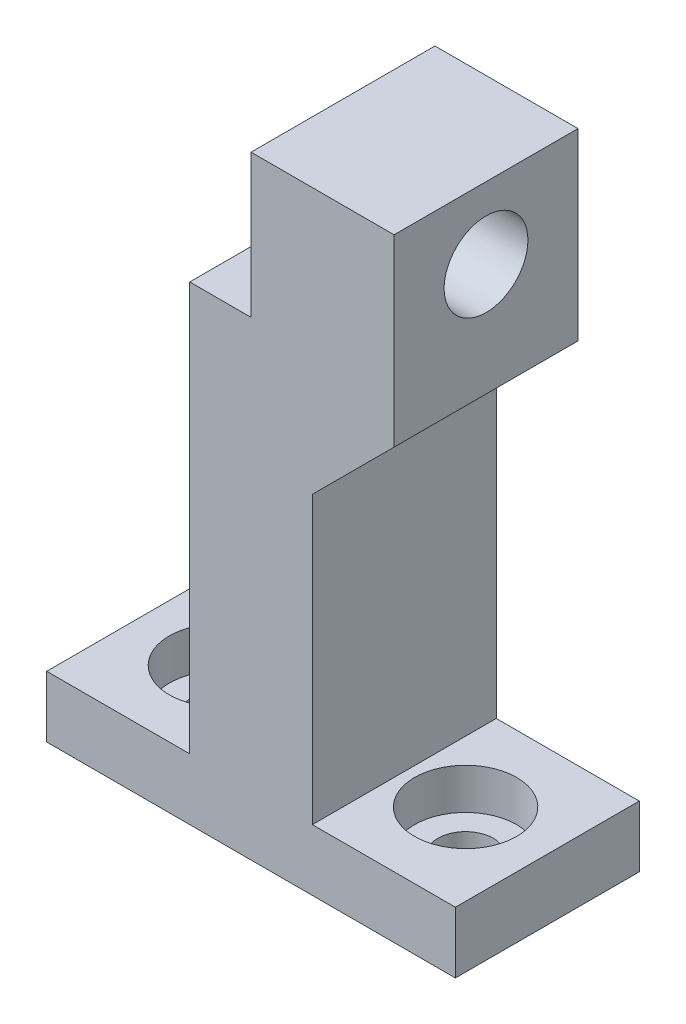
ISO-10303-21;
HEADER;
FILE_DESCRIPTION(('STEP AP214'),'2;1');
FILE_NAME('part.step','',(''),(''),'','','');
FILE_SCHEMA(('AUTOMOTIVE_DESIGN { 1 0 10303 214 1 1 1 1 }'));
ENDSEC;
DATA;
#1=APPLICATION_CONTEXT('core data for automotive mechanical design processes');
#2=APPLICATION_PROTOCOL_DEFINITION('international standard','automotive_design',2000,#1);
#3=PRODUCT_CONTEXT('',#1,'mechanical');
#4=PRODUCT('Part','Part','',(#3));
#5=PRODUCT_RELATED_PRODUCT_CATEGORY('part','',(#4));
#6=PRODUCT_DEFINITION_FORMATION('','',#4);
#7=PRODUCT_DEFINITION_CONTEXT('part definition',#1,'design');
#8=PRODUCT_DEFINITION('design','',#6,#7);
#9=PRODUCT_DEFINITION_SHAPE('','',#8);
#10=(LENGTH_UNIT() NAMED_UNIT(*) SI_UNIT(.MILLI.,.METRE.));
#11=(NAMED_UNIT(*) PLANE_ANGLE_UNIT() SI_UNIT($,.RADIAN.));
#12=(NAMED_UNIT(*) SI_UNIT($,.STERADIAN.) SOLID_ANGLE_UNIT());
#13=UNCERTAINTY_MEASURE_WITH_UNIT(LENGTH_MEASURE(1.E-05),#10,'distance_accuracy_value','');
#14=(GEOMETRIC_REPRESENTATION_CONTEXT(3) GLOBAL_UNCERTAINTY_ASSIGNED_CONTEXT((#13)) GLOBAL_UNIT_ASSIGNED_CONTEXT((#10,
#11,#12)) REPRESENTATION_CONTEXT('',''));
#15=CARTESIAN_POINT('',(0.,0.,0.));
#16=DIRECTION('',(0.,0.,1.));
#17=DIRECTION('',(1.,0.,0.));
#18=AXIS2_PLACEMENT_3D('',#15,#16,#17);
#19=CARTESIAN_POINT('',(3.,23.,-4.5));
#20=DIRECTION('',(-1.,0.,0.));
#21=DIRECTION('',(0.,0.,-1.));
#22=AXIS2_PLACEMENT_3D('',#19,#20,#21);
#23=PLANE('',#22);
#24=DIRECTION('',(0.,-1.,0.));
#25=VECTOR('',#24,1.);
#26=CARTESIAN_POINT('',(3.,23.,4.5));
#27=LINE('',#26,#25);
#28=CARTESIAN_POINT('',(3.,17.,4.5));
#29=VERTEX_POINT('',#28);
#30=CARTESIAN_POINT('',(3.,3.,4.5));
#31=VERTEX_POINT('',#30);
#32=EDGE_CURVE('E182',#29,#31,#27,.T.);
#33=ORIENTED_EDGE('',*,*,#32,.T.);
#34=DIRECTION('',(0.,0.,1.));
#35=VECTOR('',#34,1.);
#36=CARTESIAN_POINT('',(3.,3.,-4.5));
#37=LINE('',#36,#35);
#38=CARTESIAN_POINT('',(3.,3.,-4.5));
#39=VERTEX_POINT('',#38);
#40=EDGE_CURVE('E161',#39,#31,#37,.T.);
#41=ORIENTED_EDGE('',*,*,#40,.F.);
#42=DIRECTION('',(0.,-1.,0.));
#43=VECTOR('',#42,1.);
#44=CARTESIAN_POINT('',(3.,23.,-4.5));
#45=LINE('',#44,#43);
#46=CARTESIAN_POINT('',(3.,17.,-4.5));
#47=VERTEX_POINT('',#46);
#48=EDGE_CURVE('E172',#47,#39,#45,.T.);
#49=ORIENTED_EDGE('',*,*,#48,.F.);
#50=DIRECTION('',(0.,0.,-1.));
#51=VECTOR('',#50,1.);
#52=CARTESIAN_POINT('',(3.,17.,-4.5));
#53=LINE('',#52,#51);
#54=EDGE_CURVE('E241',#29,#47,#53,.T.);
#55=ORIENTED_EDGE('',*,*,#54,.F.);
#56=EDGE_LOOP('',(#33,#41,#49,#55));
#57=FACE_BOUND('',#56,.T.);
#58=ADVANCED_FACE('F35',(#57),#23,.F.);
#59=CARTESIAN_POINT('',(0.,23.,0.));
#60=DIRECTION('',(0.,-1.,0.));
#61=DIRECTION('',(0.,0.,1.));
#62=AXIS2_PLACEMENT_3D('',#59,#60,#61);
#63=PLANE('',#62);
#64=DIRECTION('',(0.,0.,-1.));
#65=VECTOR('',#64,1.);
#66=CARTESIAN_POINT('',(0.,23.,4.5));
#67=LINE('',#66,#65);
#68=CARTESIAN_POINT('',(0.,23.,4.5));
#69=VERTEX_POINT('',#68);
#70=CARTESIAN_POINT('',(0.,23.,-4.5));
#71=VERTEX_POINT('',#70);
#72=EDGE_CURVE('E140',#69,#71,#67,.T.);
#73=ORIENTED_EDGE('',*,*,#72,.T.);
#74=DIRECTION('',(1.,0.,0.));
#75=VECTOR('',#74,1.);
#76=CARTESIAN_POINT('',(-3.,23.,-4.5));
#77=LINE('',#76,#75);
#78=CARTESIAN_POINT('',(-3.,23.,-4.5));
#79=VERTEX_POINT('',#78);
#80=EDGE_CURVE('E169',#79,#71,#77,.T.);
#81=ORIENTED_EDGE('',*,*,#80,.F.);
#82=DIRECTION('',(0.,0.,-1.));
#83=VECTOR('',#82,1.);
#84=CARTESIAN_POINT('',(-3.,23.,-4.5));
#85=LINE('',#84,#83);
#86=CARTESIAN_POINT('',(-3.,23.,4.5));
#87=VERTEX_POINT('',#86);
#88=EDGE_CURVE('E165',#87,#79,#85,.T.);
#89=ORIENTED_EDGE('',*,*,#88,.F.);
#90=DIRECTION('',(-1.,0.,0.));
#91=VECTOR('',#90,1.);
#92=CARTESIAN_POINT('',(-3.,23.,4.5));
#93=LINE('',#92,#91);
#94=EDGE_CURVE('E162',#69,#87,#93,.T.);
#95=ORIENTED_EDGE('',*,*,#94,.F.);
#96=EDGE_LOOP('',(#73,#81,#89,#95));
#97=FACE_BOUND('',#96,.T.);
#98=ADVANCED_FACE('F277',(#97),#63,.F.);
#99=CARTESIAN_POINT('',(0.,3.,0.));
#100=DIRECTION('',(0.,-1.,0.));
#101=DIRECTION('',(0.,0.,1.));
#102=AXIS2_PLACEMENT_3D('',#99,#100,#101);
#103=PLANE('',#102);
#104=CARTESIAN_POINT('',(6.,3.,0.));
#105=DIRECTION('',(0.,-1.,0.));
#106=DIRECTION('',(0.,0.,-1.));
#107=AXIS2_PLACEMENT_3D('',#104,#105,#106);
#108=CIRCLE('',#107,2.5);
#109=CARTESIAN_POINT('',(6.,3.,-2.5));
#110=VERTEX_POINT('',#109);
#111=EDGE_CURVE('E185',#110,#110,#108,.T.);
#112=ORIENTED_EDGE('',*,*,#111,.T.);
#113=EDGE_LOOP('',(#112));
#114=FACE_BOUND('',#113,.T.);
#115=ORIENTED_EDGE('',*,*,#40,.T.);
#116=DIRECTION('',(-1.,0.,0.));
#117=VECTOR('',#116,1.);
#118=CARTESIAN_POINT('',(-10.,3.,4.5));
#119=LINE('',#118,#117);
#120=CARTESIAN_POINT('',(10.,3.,4.5));
#121=VERTEX_POINT('',#120);
#122=EDGE_CURVE('E211',#121,#31,#119,.T.);
#123=ORIENTED_EDGE('',*,*,#122,.F.);
#124=DIRECTION('',(0.,0.,1.));
#125=VECTOR('',#124,1.);
#126=CARTESIAN_POINT('',(10.,3.,-4.5));
#127=LINE('',#126,#125);
#128=CARTESIAN_POINT('',(10.,3.,-4.5));
#129=VERTEX_POINT('',#128);
#130=EDGE_CURVE('E206',#129,#121,#127,.T.);
#131=ORIENTED_EDGE('',*,*,#130,.F.);
#132=DIRECTION('',(1.,0.,0.));
#133=VECTOR('',#132,1.);
#134=CARTESIAN_POINT('',(-10.,3.,-4.5));
#135=LINE('',#134,#133);
#136=EDGE_CURVE('E216',#39,#129,#135,.T.);
#137=ORIENTED_EDGE('',*,*,#136,.F.);
#138=EDGE_LOOP('',(#115,#123,#131,#137));
#139=FACE_BOUND('',#138,.T.);
#140=ADVANCED_FACE('F256',(#114,#139),#103,.F.);
#141=CARTESIAN_POINT('',(-6.,3.,0.));
#142=DIRECTION('',(0.,-1.,0.));
#143=DIRECTION('',(0.,0.,-1.));
#144=AXIS2_PLACEMENT_3D('',#141,#142,#143);
#145=CIRCLE('',#144,2.5);
#146=CARTESIAN_POINT('',(-6.,3.,-2.5));
#147=VERTEX_POINT('',#146);
#148=EDGE_CURVE('E190',#147,#147,#145,.T.);
#149=ORIENTED_EDGE('',*,*,#148,.T.);
#150=EDGE_LOOP('',(#149));
#151=FACE_BOUND('',#150,.T.);
#152=DIRECTION('',(0.,0.,-1.));
#153=VECTOR('',#152,1.);
#154=CARTESIAN_POINT('',(-3.,3.,-4.5));
#155=LINE('',#154,#153);
#156=CARTESIAN_POINT('',(-3.,3.,4.5));
#157=VERTEX_POINT('',#156);
#158=CARTESIAN_POINT('',(-3.,3.,-4.5));
#159=VERTEX_POINT('',#158);
#160=EDGE_CURVE('E166',#157,#159,#155,.T.);
#161=ORIENTED_EDGE('',*,*,#160,.T.);
#162=CARTESIAN_POINT('',(-10.,3.,-4.5));
#163=VERTEX_POINT('',#162);
#164=EDGE_CURVE('E217',#163,#159,#135,.T.);
#165=ORIENTED_EDGE('',*,*,#164,.F.);
#166=DIRECTION('',(0.,0.,-1.));
#167=VECTOR('',#166,1.);
#168=CARTESIAN_POINT('',(-10.,3.,-4.5));
#169=LINE('',#168,#167);
#170=CARTESIAN_POINT('',(-10.,3.,4.5));
#171=VERTEX_POINT('',#170);
#172=EDGE_CURVE('E213',#171,#163,#169,.T.);
#173=ORIENTED_EDGE('',*,*,#172,.F.);
#174=EDGE_CURVE('E209',#157,#171,#119,.T.);
#175=ORIENTED_EDGE('',*,*,#174,.F.);
#176=EDGE_LOOP('',(#161,#165,#173,#175));
#177=FACE_BOUND('',#176,.T.);
#178=ADVANCED_FACE('F268',(#151,#177),#103,.F.);
#179=CARTESIAN_POINT('',(6.,0.,0.));
#180=DIRECTION('',(0.,1.,0.));
#181=DIRECTION('',(0.,0.,-1.));
#182=AXIS2_PLACEMENT_3D('',#179,#180,#181);
#183=CYLINDRICAL_SURFACE('',#182,1.35);
#184=CARTESIAN_POINT('',(6.,0.,0.));
#185=DIRECTION('',(0.,-1.,0.));
#186=DIRECTION('',(0.,0.,-1.));
#187=AXIS2_PLACEMENT_3D('',#184,#185,#186);
#188=CIRCLE('',#187,1.35);
#189=CARTESIAN_POINT('',(6.,0.,-1.35));
#190=VERTEX_POINT('',#189);
#191=EDGE_CURVE('E202',#190,#190,#188,.T.);
#192=ORIENTED_EDGE('',*,*,#191,.T.);
#193=EDGE_LOOP('',(#192));
#194=FACE_BOUND('',#193,.T.);
#195=CARTESIAN_POINT('',(6.,1.,0.));
#196=DIRECTION('',(0.,-1.,0.));
#197=DIRECTION('',(0.,0.,-1.));
#198=AXIS2_PLACEMENT_3D('',#195,#196,#197);
#199=CIRCLE('',#198,1.35);
#200=CARTESIAN_POINT('',(6.,1.,-1.35));
#201=VERTEX_POINT('',#200);
#202=EDGE_CURVE('E205',#201,#201,#199,.F.);
#203=ORIENTED_EDGE('',*,*,#202,.T.);
#204=EDGE_LOOP('',(#203));
#205=FACE_BOUND('',#204,.T.);
#206=ADVANCED_FACE('F317',(#194,#205),#183,.F.);
#207=CARTESIAN_POINT('',(-6.,0.,0.));
#208=DIRECTION('',(0.,1.,0.));
#209=DIRECTION('',(0.,0.,-1.));
#210=AXIS2_PLACEMENT_3D('',#207,#208,#209);
#211=CYLINDRICAL_SURFACE('',#210,1.35);
#212=CARTESIAN_POINT('',(-6.,0.,0.));
#213=DIRECTION('',(0.,-1.,0.));
#214=DIRECTION('',(0.,0.,-1.));
#215=AXIS2_PLACEMENT_3D('',#212,#213,#214);
#216=CIRCLE('',#215,1.35);
#217=CARTESIAN_POINT('',(-6.,0.,-1.35));
#218=VERTEX_POINT('',#217);
#219=EDGE_CURVE('E198',#218,#218,#216,.T.);
#220=ORIENTED_EDGE('',*,*,#219,.T.);
#221=EDGE_LOOP('',(#220));
#222=FACE_BOUND('',#221,.T.);
#223=CARTESIAN_POINT('',(-6.,1.,0.));
#224=DIRECTION('',(0.,-1.,0.));
#225=DIRECTION('',(0.,0.,-1.));
#226=AXIS2_PLACEMENT_3D('',#223,#224,#225);
#227=CIRCLE('',#226,1.35);
#228=CARTESIAN_POINT('',(-6.,1.,-1.35));
#229=VERTEX_POINT('',#228);
#230=EDGE_CURVE('E189',#229,#229,#227,.F.);
#231=ORIENTED_EDGE('',*,*,#230,.T.);
#232=EDGE_LOOP('',(#231));
#233=FACE_BOUND('',#232,.T.);
#234=ADVANCED_FACE('F314',(#222,#233),#211,.F.);
#235=CARTESIAN_POINT('',(10.,3.,-4.5));
#236=DIRECTION('',(-1.,0.,0.));
#237=DIRECTION('',(0.,0.,-1.));
#238=AXIS2_PLACEMENT_3D('',#235,#236,#237);
#239=PLANE('',#238);
#240=DIRECTION('',(0.,0.,1.));
#241=VECTOR('',#240,1.);
#242=CARTESIAN_POINT('',(10.,0.,-4.5));
#243=LINE('',#242,#241);
#244=CARTESIAN_POINT('',(10.,0.,-4.5));
#245=VERTEX_POINT('',#244);
#246=CARTESIAN_POINT('',(10.,0.,4.5));
#247=VERTEX_POINT('',#246);
#248=EDGE_CURVE('E201',#245,#247,#243,.T.);
#249=ORIENTED_EDGE('',*,*,#248,.F.);
#250=DIRECTION('',(0.,-1.,0.));
#251=VECTOR('',#250,1.);
#252=CARTESIAN_POINT('',(10.,3.,-4.5));
#253=LINE('',#252,#251);
#254=EDGE_CURVE('E220',#129,#245,#253,.T.);
#255=ORIENTED_EDGE('',*,*,#254,.F.);
#256=ORIENTED_EDGE('',*,*,#130,.T.);
#257=DIRECTION('',(0.,-1.,0.));
#258=VECTOR('',#257,1.);
#259=CARTESIAN_POINT('',(10.,3.,4.5));
#260=LINE('',#259,#258);
#261=EDGE_CURVE('E238',#121,#247,#260,.T.);
#262=ORIENTED_EDGE('',*,*,#261,.T.);
#263=EDGE_LOOP('',(#249,#255,#256,#262));
#264=FACE_BOUND('',#263,.T.);
#265=ADVANCED_FACE('F258',(#264),#239,.F.);
#266=CARTESIAN_POINT('',(-10.,3.,4.5));
#267=DIRECTION('',(0.,0.,-1.));
#268=DIRECTION('',(1.,0.,0.));
#269=AXIS2_PLACEMENT_3D('',#266,#267,#268);
#270=PLANE('',#269);
#271=DIRECTION('',(-1.,0.,0.));
#272=VECTOR('',#271,1.);
#273=CARTESIAN_POINT('',(-10.,0.,4.5));
#274=LINE('',#273,#272);
#275=CARTESIAN_POINT('',(-10.,0.,4.5));
#276=VERTEX_POINT('',#275);
#277=EDGE_CURVE('E223',#247,#276,#274,.T.);
#278=ORIENTED_EDGE('',*,*,#277,.F.);
#279=ORIENTED_EDGE('',*,*,#261,.F.);
#280=ORIENTED_EDGE('',*,*,#122,.T.);
#281=ORIENTED_EDGE('',*,*,#32,.F.);
#282=DIRECTION('',(0.707106781186549,0.707106781186546,0.));
#283=VECTOR('',#282,1.);
#284=CARTESIAN_POINT('',(-10.5,3.50000000000003,4.5));
#285=LINE('',#284,#283);
#286=CARTESIAN_POINT('',(7.,21.,4.5));
#287=VERTEX_POINT('',#286);
#288=EDGE_CURVE('E44',#287,#29,#285,.F.);
#289=ORIENTED_EDGE('',*,*,#288,.F.);
#290=DIRECTION('',(0.,1.,0.));
#291=VECTOR('',#290,1.);
#292=CARTESIAN_POINT('',(7.,30.,4.5));
#293=LINE('',#292,#291);
#294=CARTESIAN_POINT('',(7.,30.,4.5));
#295=VERTEX_POINT('',#294);
#296=EDGE_CURVE('E128',#287,#295,#293,.T.);
#297=ORIENTED_EDGE('',*,*,#296,.T.);
#298=DIRECTION('',(-1.,0.,0.));
#299=VECTOR('',#298,1.);
#300=CARTESIAN_POINT('',(3.,30.,4.5));
#301=LINE('',#300,#299);
#302=CARTESIAN_POINT('',(0.,30.,4.5));
#303=VERTEX_POINT('',#302);
#304=EDGE_CURVE('E135',#295,#303,#301,.T.);
#305=ORIENTED_EDGE('',*,*,#304,.T.);
#306=DIRECTION('',(0.,-1.,0.));
#307=VECTOR('',#306,1.);
#308=CARTESIAN_POINT('',(0.,30.,4.5));
#309=LINE('',#308,#307);
#310=EDGE_CURVE('E159',#303,#69,#309,.T.);
#311=ORIENTED_EDGE('',*,*,#310,.T.);
#312=ORIENTED_EDGE('',*,*,#94,.T.);
#313=DIRECTION('',(0.,-1.,0.));
#314=VECTOR('',#313,1.);
#315=CARTESIAN_POINT('',(-3.,23.,4.5));
#316=LINE('',#315,#314);
#317=EDGE_CURVE('E180',#87,#157,#316,.T.);
#318=ORIENTED_EDGE('',*,*,#317,.T.);
#319=ORIENTED_EDGE('',*,*,#174,.T.);
#320=DIRECTION('',(0.,-1.,0.));
#321=VECTOR('',#320,1.);
#322=CARTESIAN_POINT('',(-10.,3.,4.5));
#323=LINE('',#322,#321);
#324=EDGE_CURVE('E235',#171,#276,#323,.T.);
#325=ORIENTED_EDGE('',*,*,#324,.T.);
#326=EDGE_LOOP('',(#278,#279,#280,#281,#289,#297,#305,#311,#312,#318,#319,#325));
#327=FACE_BOUND('',#326,.T.);
#328=ADVANCED_FACE('F142',(#327),#270,.F.);
#329=CARTESIAN_POINT('',(-10.,3.,-4.5));
#330=DIRECTION('',(1.,0.,0.));
#331=DIRECTION('',(0.,0.,1.));
#332=AXIS2_PLACEMENT_3D('',#329,#330,#331);
#333=PLANE('',#332);
#334=DIRECTION('',(0.,0.,-1.));
#335=VECTOR('',#334,1.);
#336=CARTESIAN_POINT('',(-10.,0.,-4.5));
#337=LINE('',#336,#335);
#338=CARTESIAN_POINT('',(-10.,0.,-4.5));
#339=VERTEX_POINT('',#338);
#340=EDGE_CURVE('E226',#276,#339,#337,.T.);
#341=ORIENTED_EDGE('',*,*,#340,.F.);
#342=ORIENTED_EDGE('',*,*,#324,.F.);
#343=ORIENTED_EDGE('',*,*,#172,.T.);
#344=DIRECTION('',(0.,-1.,0.));
#345=VECTOR('',#344,1.);
#346=CARTESIAN_POINT('',(-10.,3.,-4.5));
#347=LINE('',#346,#345);
#348=EDGE_CURVE('E232',#163,#339,#347,.T.);
#349=ORIENTED_EDGE('',*,*,#348,.T.);
#350=EDGE_LOOP('',(#341,#342,#343,#349));
#351=FACE_BOUND('',#350,.T.);
#352=ADVANCED_FACE('F262',(#351),#333,.F.);
#353=CARTESIAN_POINT('',(-10.,3.,-4.5));
#354=DIRECTION('',(0.,0.,1.));
#355=DIRECTION('',(-1.,0.,0.));
#356=AXIS2_PLACEMENT_3D('',#353,#354,#355);
#357=PLANE('',#356);
#358=DIRECTION('',(1.,0.,0.));
#359=VECTOR('',#358,1.);
#360=CARTESIAN_POINT('',(-10.,0.,-4.5));
#361=LINE('',#360,#359);
#362=EDGE_CURVE('E210',#339,#245,#361,.T.);
#363=ORIENTED_EDGE('',*,*,#362,.F.);
#364=ORIENTED_EDGE('',*,*,#348,.F.);
#365=ORIENTED_EDGE('',*,*,#164,.T.);
#366=DIRECTION('',(0.,-1.,0.));
#367=VECTOR('',#366,1.);
#368=CARTESIAN_POINT('',(-3.,23.,-4.5));
#369=LINE('',#368,#367);
#370=EDGE_CURVE('E178',#79,#159,#369,.T.);
#371=ORIENTED_EDGE('',*,*,#370,.F.);
#372=ORIENTED_EDGE('',*,*,#80,.T.);
#373=DIRECTION('',(0.,-1.,0.));
#374=VECTOR('',#373,1.);
#375=CARTESIAN_POINT('',(0.,30.,-4.5));
#376=LINE('',#375,#374);
#377=CARTESIAN_POINT('',(0.,30.,-4.5));
#378=VERTEX_POINT('',#377);
#379=EDGE_CURVE('E155',#378,#71,#376,.T.);
#380=ORIENTED_EDGE('',*,*,#379,.F.);
#381=DIRECTION('',(1.,0.,0.));
#382=VECTOR('',#381,1.);
#383=CARTESIAN_POINT('',(3.,30.,-4.5));
#384=LINE('',#383,#382);
#385=CARTESIAN_POINT('',(7.,30.,-4.5));
#386=VERTEX_POINT('',#385);
#387=EDGE_CURVE('E153',#378,#386,#384,.T.);
#388=ORIENTED_EDGE('',*,*,#387,.T.);
#389=DIRECTION('',(0.,-1.,0.));
#390=VECTOR('',#389,1.);
#391=CARTESIAN_POINT('',(7.,30.,-4.5));
#392=LINE('',#391,#390);
#393=CARTESIAN_POINT('',(7.,21.,-4.5));
#394=VERTEX_POINT('',#393);
#395=EDGE_CURVE('E129',#386,#394,#392,.T.);
#396=ORIENTED_EDGE('',*,*,#395,.T.);
#397=DIRECTION('',(-0.707106781186549,-0.707106781186546,0.));
#398=VECTOR('',#397,1.);
#399=CARTESIAN_POINT('',(-10.5,3.50000000000003,-4.5));
#400=LINE('',#399,#398);
#401=EDGE_CURVE('E11',#47,#394,#400,.F.);
#402=ORIENTED_EDGE('',*,*,#401,.F.);
#403=ORIENTED_EDGE('',*,*,#48,.T.);
#404=ORIENTED_EDGE('',*,*,#136,.T.);
#405=ORIENTED_EDGE('',*,*,#254,.T.);
#406=EDGE_LOOP('',(#363,#364,#365,#371,#372,#380,#388,#396,#402,#403,#404,#405));
#407=FACE_BOUND('',#406,.T.);
#408=ADVANCED_FACE('F251',(#407),#357,.F.);
#409=CARTESIAN_POINT('',(0.,0.,0.));
#410=DIRECTION('',(0.,-1.,0.));
#411=DIRECTION('',(0.,0.,1.));
#412=AXIS2_PLACEMENT_3D('',#409,#410,#411);
#413=PLANE('',#412);
#414=ORIENTED_EDGE('',*,*,#219,.F.);
#415=EDGE_LOOP('',(#414));
#416=FACE_BOUND('',#415,.T.);
#417=ORIENTED_EDGE('',*,*,#191,.F.);
#418=EDGE_LOOP('',(#417));
#419=FACE_BOUND('',#418,.T.);
#420=ORIENTED_EDGE('',*,*,#248,.T.);
#421=ORIENTED_EDGE('',*,*,#277,.T.);
#422=ORIENTED_EDGE('',*,*,#340,.T.);
#423=ORIENTED_EDGE('',*,*,#362,.T.);
#424=EDGE_LOOP('',(#420,#421,#422,#423));
#425=FACE_BOUND('',#424,.T.);
#426=ADVANCED_FACE('F260',(#416,#419,#425),#413,.T.);
#427=CARTESIAN_POINT('',(-6.,1.,0.));
#428=DIRECTION('',(0.,1.,0.));
#429=DIRECTION('',(0.,0.,-1.));
#430=AXIS2_PLACEMENT_3D('',#427,#428,#429);
#431=PLANE('',#430);
#432=CARTESIAN_POINT('',(-6.,1.,0.));
#433=DIRECTION('',(0.,-1.,0.));
#434=DIRECTION('',(0.,0.,-1.));
#435=AXIS2_PLACEMENT_3D('',#432,#433,#434);
#436=CIRCLE('',#435,2.5);
#437=CARTESIAN_POINT('',(-6.,1.,-2.5));
#438=VERTEX_POINT('',#437);
#439=EDGE_CURVE('E186',#438,#438,#436,.T.);
#440=ORIENTED_EDGE('',*,*,#439,.F.);
#441=EDGE_LOOP('',(#440));
#442=FACE_BOUND('',#441,.T.);
#443=ORIENTED_EDGE('',*,*,#230,.F.);
#444=EDGE_LOOP('',(#443));
#445=FACE_BOUND('',#444,.T.);
#446=ADVANCED_FACE('F299',(#442,#445),#431,.T.);
#447=CARTESIAN_POINT('',(-6.,1.,0.));
#448=DIRECTION('',(0.,1.,0.));
#449=DIRECTION('',(0.,0.,-1.));
#450=AXIS2_PLACEMENT_3D('',#447,#448,#449);
#451=CYLINDRICAL_SURFACE('',#450,2.5);
#452=ORIENTED_EDGE('',*,*,#439,.T.);
#453=EDGE_LOOP('',(#452));
#454=FACE_BOUND('',#453,.T.);
#455=ORIENTED_EDGE('',*,*,#148,.F.);
#456=EDGE_LOOP('',(#455));
#457=FACE_BOUND('',#456,.T.);
#458=ADVANCED_FACE('F302',(#454,#457),#451,.F.);
#459=CARTESIAN_POINT('',(6.,1.,0.));
#460=DIRECTION('',(0.,1.,0.));
#461=DIRECTION('',(0.,0.,-1.));
#462=AXIS2_PLACEMENT_3D('',#459,#460,#461);
#463=PLANE('',#462);
#464=CARTESIAN_POINT('',(6.,1.,0.));
#465=DIRECTION('',(0.,-1.,0.));
#466=DIRECTION('',(0.,0.,-1.));
#467=AXIS2_PLACEMENT_3D('',#464,#465,#466);
#468=CIRCLE('',#467,2.5);
#469=CARTESIAN_POINT('',(6.,1.,-2.5));
#470=VERTEX_POINT('',#469);
#471=EDGE_CURVE('E193',#470,#470,#468,.T.);
#472=ORIENTED_EDGE('',*,*,#471,.F.);
#473=EDGE_LOOP('',(#472));
#474=FACE_BOUND('',#473,.T.);
#475=ORIENTED_EDGE('',*,*,#202,.F.);
#476=EDGE_LOOP('',(#475));
#477=FACE_BOUND('',#476,.T.);
#478=ADVANCED_FACE('F306',(#474,#477),#463,.T.);
#479=CARTESIAN_POINT('',(6.,1.,0.));
#480=DIRECTION('',(0.,1.,0.));
#481=DIRECTION('',(0.,0.,-1.));
#482=AXIS2_PLACEMENT_3D('',#479,#480,#481);
#483=CYLINDRICAL_SURFACE('',#482,2.5);
#484=ORIENTED_EDGE('',*,*,#471,.T.);
#485=EDGE_LOOP('',(#484));
#486=FACE_BOUND('',#485,.T.);
#487=ORIENTED_EDGE('',*,*,#111,.F.);
#488=EDGE_LOOP('',(#487));
#489=FACE_BOUND('',#488,.T.);
#490=ADVANCED_FACE('F289',(#486,#489),#483,.F.);
#491=CARTESIAN_POINT('',(-3.,23.,-4.5));
#492=DIRECTION('',(1.,0.,0.));
#493=DIRECTION('',(0.,0.,1.));
#494=AXIS2_PLACEMENT_3D('',#491,#492,#493);
#495=PLANE('',#494);
#496=ORIENTED_EDGE('',*,*,#160,.F.);
#497=ORIENTED_EDGE('',*,*,#317,.F.);
#498=ORIENTED_EDGE('',*,*,#88,.T.);
#499=ORIENTED_EDGE('',*,*,#370,.T.);
#500=EDGE_LOOP('',(#496,#497,#498,#499));
#501=FACE_BOUND('',#500,.T.);
#502=ADVANCED_FACE('F274',(#501),#495,.F.);
#503=CARTESIAN_POINT('',(0.,30.,4.5));
#504=DIRECTION('',(1.,0.,0.));
#505=DIRECTION('',(0.,0.,1.));
#506=AXIS2_PLACEMENT_3D('',#503,#504,#505);
#507=PLANE('',#506);
#508=CARTESIAN_POINT('',(0.,26.5,0.));
#509=DIRECTION('',(1.,0.,0.));
#510=DIRECTION('',(0.,0.,-1.));
#511=AXIS2_PLACEMENT_3D('',#508,#509,#510);
#512=CIRCLE('',#511,2.05);
#513=CARTESIAN_POINT('',(0.,26.5,-2.05));
#514=VERTEX_POINT('',#513);
#515=EDGE_CURVE('E146',#514,#514,#512,.T.);
#516=ORIENTED_EDGE('',*,*,#515,.T.);
#517=EDGE_LOOP('',(#516));
#518=FACE_BOUND('',#517,.T.);
#519=ORIENTED_EDGE('',*,*,#72,.F.);
#520=ORIENTED_EDGE('',*,*,#310,.F.);
#521=DIRECTION('',(0.,0.,-1.));
#522=VECTOR('',#521,1.);
#523=CARTESIAN_POINT('',(0.,30.,4.5));
#524=LINE('',#523,#522);
#525=EDGE_CURVE('E137',#303,#378,#524,.T.);
#526=ORIENTED_EDGE('',*,*,#525,.T.);
#527=ORIENTED_EDGE('',*,*,#379,.T.);
#528=EDGE_LOOP('',(#519,#520,#526,#527));
#529=FACE_BOUND('',#528,.T.);
#530=ADVANCED_FACE('F280',(#518,#529),#507,.F.);
#531=CARTESIAN_POINT('',(0.,30.,0.));
#532=DIRECTION('',(0.,-1.,0.));
#533=DIRECTION('',(0.,0.,1.));
#534=AXIS2_PLACEMENT_3D('',#531,#532,#533);
#535=PLANE('',#534);
#536=ORIENTED_EDGE('',*,*,#387,.F.);
#537=ORIENTED_EDGE('',*,*,#525,.F.);
#538=ORIENTED_EDGE('',*,*,#304,.F.);
#539=DIRECTION('',(0.,0.,-1.));
#540=VECTOR('',#539,1.);
#541=CARTESIAN_POINT('',(7.,30.,4.5));
#542=LINE('',#541,#540);
#543=EDGE_CURVE('E124',#295,#386,#542,.T.);
#544=ORIENTED_EDGE('',*,*,#543,.T.);
#545=EDGE_LOOP('',(#536,#537,#538,#544));
#546=FACE_BOUND('',#545,.T.);
#547=ADVANCED_FACE('F136',(#546),#535,.F.);
#548=CARTESIAN_POINT('',(7.,0.,0.));
#549=DIRECTION('',(-1.,0.,0.));
#550=DIRECTION('',(0.,0.,-1.));
#551=AXIS2_PLACEMENT_3D('',#548,#549,#550);
#552=PLANE('',#551);
#553=CARTESIAN_POINT('',(7.,26.5,0.));
#554=DIRECTION('',(1.,0.,0.));
#555=DIRECTION('',(0.,0.,-1.));
#556=AXIS2_PLACEMENT_3D('',#553,#554,#555);
#557=CIRCLE('',#556,2.05);
#558=CARTESIAN_POINT('',(7.,26.5,-2.05));
#559=VERTEX_POINT('',#558);
#560=EDGE_CURVE('E39',#559,#559,#557,.T.);
#561=ORIENTED_EDGE('',*,*,#560,.F.);
#562=EDGE_LOOP('',(#561));
#563=FACE_BOUND('',#562,.T.);
#564=ORIENTED_EDGE('',*,*,#296,.F.);
#565=DIRECTION('',(0.,0.,1.));
#566=VECTOR('',#565,1.);
#567=CARTESIAN_POINT('',(7.,21.,4.5));
#568=LINE('',#567,#566);
#569=EDGE_CURVE('E150',#394,#287,#568,.T.);
#570=ORIENTED_EDGE('',*,*,#569,.F.);
#571=ORIENTED_EDGE('',*,*,#395,.F.);
#572=ORIENTED_EDGE('',*,*,#543,.F.);
#573=EDGE_LOOP('',(#564,#570,#571,#572));
#574=FACE_BOUND('',#573,.T.);
#575=ADVANCED_FACE('F126',(#563,#574),#552,.F.);
#576=CARTESIAN_POINT('',(7.,21.,4.5));
#577=DIRECTION('',(0.707106781186546,-0.707106781186549,0.));
#578=DIRECTION('',(0.,0.,-1.));
#579=AXIS2_PLACEMENT_3D('',#576,#577,#578);
#580=PLANE('',#579);
#581=ORIENTED_EDGE('',*,*,#401,.T.);
#582=ORIENTED_EDGE('',*,*,#569,.T.);
#583=ORIENTED_EDGE('',*,*,#288,.T.);
#584=ORIENTED_EDGE('',*,*,#54,.T.);
#585=EDGE_LOOP('',(#581,#582,#583,#584));
#586=FACE_BOUND('',#585,.T.);
#587=ADVANCED_FACE('F37',(#586),#580,.T.);
#588=CARTESIAN_POINT('',(10.,26.5,0.));
#589=DIRECTION('',(-1.,0.,0.));
#590=DIRECTION('',(0.,0.,-1.));
#591=AXIS2_PLACEMENT_3D('',#588,#589,#590);
#592=CYLINDRICAL_SURFACE('',#591,2.05);
#593=ORIENTED_EDGE('',*,*,#515,.F.);
#594=EDGE_LOOP('',(#593));
#595=FACE_BOUND('',#594,.T.);
#596=ORIENTED_EDGE('',*,*,#560,.T.);
#597=EDGE_LOOP('',(#596));
#598=FACE_BOUND('',#597,.T.);
#599=ADVANCED_FACE('F403',(#595,#598),#592,.F.);
#600=CLOSED_SHELL('',(#58,#98,#140,#178,#206,#234,#265,#328,#352,#408,#426,#446,#458,#478,#490,
#502,#530,#547,#575,#587,#599));
#601=MANIFOLD_SOLID_BREP('B2',#600);
#602=ADVANCED_BREP_SHAPE_REPRESENTATION('',(#18,#601),#14);
#603=SHAPE_DEFINITION_REPRESENTATION(#9,#602);
ENDSEC;
END-ISO-10303-21;
